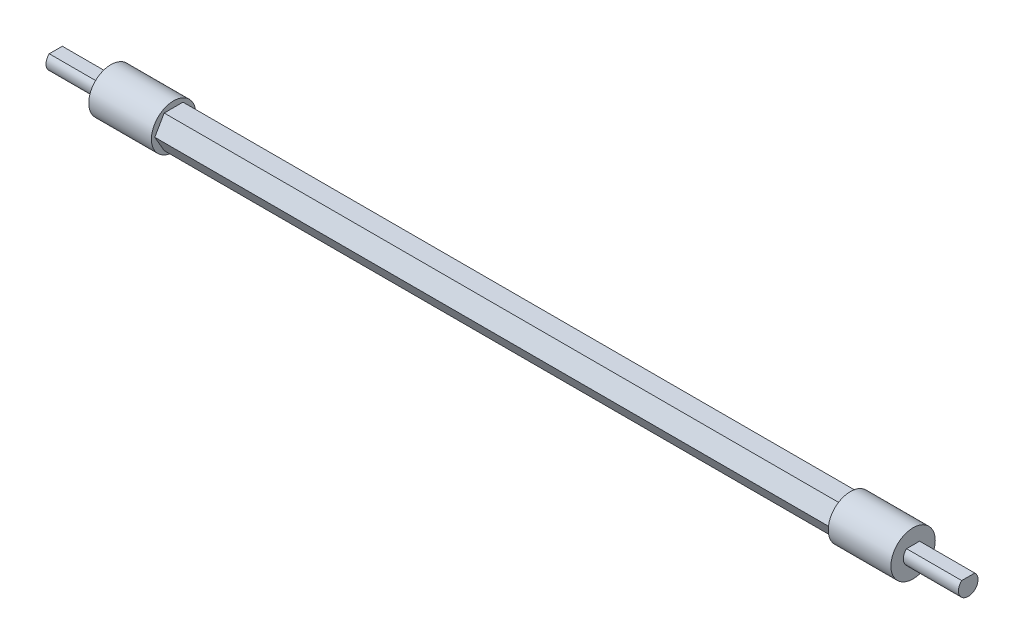
ISO-10303-21;
HEADER;
FILE_DESCRIPTION(('STEP AP214'),'2;1');
FILE_NAME('part.step','',(''),(''),'','','');
FILE_SCHEMA(('AUTOMOTIVE_DESIGN { 1 0 10303 214 1 1 1 1 }'));
ENDSEC;
DATA;
#1=APPLICATION_CONTEXT('core data for automotive mechanical design processes');
#2=APPLICATION_PROTOCOL_DEFINITION('international standard','automotive_design',2000,#1);
#3=PRODUCT_CONTEXT('',#1,'mechanical');
#4=PRODUCT('Part','Part','',(#3));
#5=PRODUCT_RELATED_PRODUCT_CATEGORY('part','',(#4));
#6=PRODUCT_DEFINITION_FORMATION('','',#4);
#7=PRODUCT_DEFINITION_CONTEXT('part definition',#1,'design');
#8=PRODUCT_DEFINITION('design','',#6,#7);
#9=PRODUCT_DEFINITION_SHAPE('','',#8);
#10=(LENGTH_UNIT() NAMED_UNIT(*) SI_UNIT(.MILLI.,.METRE.));
#11=(NAMED_UNIT(*) PLANE_ANGLE_UNIT() SI_UNIT($,.RADIAN.));
#12=(NAMED_UNIT(*) SI_UNIT($,.STERADIAN.) SOLID_ANGLE_UNIT());
#13=UNCERTAINTY_MEASURE_WITH_UNIT(LENGTH_MEASURE(1.E-05),#10,'distance_accuracy_value','');
#14=(GEOMETRIC_REPRESENTATION_CONTEXT(3) GLOBAL_UNCERTAINTY_ASSIGNED_CONTEXT((#13)) GLOBAL_UNIT_ASSIGNED_CONTEXT((#10,
#11,#12)) REPRESENTATION_CONTEXT('',''));
#15=CARTESIAN_POINT('',(0.,0.,0.));
#16=DIRECTION('',(0.,0.,1.));
#17=DIRECTION('',(1.,0.,0.));
#18=AXIS2_PLACEMENT_3D('',#15,#16,#17);
#19=CARTESIAN_POINT('',(-80.,0.,0.));
#20=DIRECTION('',(-1.,0.,0.));
#21=DIRECTION('',(0.,0.,-1.));
#22=AXIS2_PLACEMENT_3D('',#19,#20,#21);
#23=PLANE('',#22);
#24=CARTESIAN_POINT('',(-80.,0.,0.));
#25=DIRECTION('',(1.,0.,0.));
#26=DIRECTION('',(0.,0.,-1.));
#27=AXIS2_PLACEMENT_3D('',#24,#25,#26);
#28=CIRCLE('',#27,4.425);
#29=CARTESIAN_POINT('',(-80.,0.,-4.425));
#30=VERTEX_POINT('',#29);
#31=EDGE_CURVE('E150',#30,#30,#28,.T.);
#32=ORIENTED_EDGE('',*,*,#31,.F.);
#33=EDGE_LOOP('',(#32));
#34=FACE_BOUND('',#33,.T.);
#35=DIRECTION('',(0.,0.,-1.));
#36=VECTOR('',#35,1.);
#37=CARTESIAN_POINT('',(-80.,1.45,0.));
#38=LINE('',#37,#36);
#39=CARTESIAN_POINT('',(-80.,1.45,1.30384048104053));
#40=VERTEX_POINT('',#39);
#41=CARTESIAN_POINT('',(-80.,1.45,-1.30384048104053));
#42=VERTEX_POINT('',#41);
#43=EDGE_CURVE('E61',#40,#42,#38,.T.);
#44=ORIENTED_EDGE('',*,*,#43,.F.);
#45=CARTESIAN_POINT('',(-80.,0.,0.));
#46=DIRECTION('',(1.,0.,0.));
#47=DIRECTION('',(0.,0.,-1.));
#48=AXIS2_PLACEMENT_3D('',#45,#46,#47);
#49=CIRCLE('',#48,1.95);
#50=EDGE_CURVE('E129',#40,#42,#49,.T.);
#51=ORIENTED_EDGE('',*,*,#50,.T.);
#52=EDGE_LOOP('',(#44,#51));
#53=FACE_BOUND('',#52,.T.);
#54=ADVANCED_FACE('F45',(#34,#53),#23,.T.);
#55=CARTESIAN_POINT('',(80.,0.,0.));
#56=DIRECTION('',(1.,0.,0.));
#57=DIRECTION('',(0.,0.,-1.));
#58=AXIS2_PLACEMENT_3D('',#55,#56,#57);
#59=PLANE('',#58);
#60=CARTESIAN_POINT('',(80.,0.,0.));
#61=DIRECTION('',(1.,0.,0.));
#62=DIRECTION('',(0.,0.,-1.));
#63=AXIS2_PLACEMENT_3D('',#60,#61,#62);
#64=CIRCLE('',#63,4.425);
#65=CARTESIAN_POINT('',(80.,0.,-4.425));
#66=VERTEX_POINT('',#65);
#67=EDGE_CURVE('E177',#66,#66,#64,.T.);
#68=ORIENTED_EDGE('',*,*,#67,.T.);
#69=EDGE_LOOP('',(#68));
#70=FACE_BOUND('',#69,.T.);
#71=CARTESIAN_POINT('',(80.,0.,0.));
#72=DIRECTION('',(1.,0.,0.));
#73=DIRECTION('',(0.,0.,-1.));
#74=AXIS2_PLACEMENT_3D('',#71,#72,#73);
#75=CIRCLE('',#74,1.95);
#76=CARTESIAN_POINT('',(80.,1.45,1.30384048104053));
#77=VERTEX_POINT('',#76);
#78=CARTESIAN_POINT('',(80.,1.45,-1.30384048104053));
#79=VERTEX_POINT('',#78);
#80=EDGE_CURVE('E68',#77,#79,#75,.T.);
#81=ORIENTED_EDGE('',*,*,#80,.F.);
#82=DIRECTION('',(0.,0.,-1.));
#83=VECTOR('',#82,1.);
#84=CARTESIAN_POINT('',(80.,1.45,0.));
#85=LINE('',#84,#83);
#86=EDGE_CURVE('E154',#77,#79,#85,.T.);
#87=ORIENTED_EDGE('',*,*,#86,.T.);
#88=EDGE_LOOP('',(#81,#87));
#89=FACE_BOUND('',#88,.T.);
#90=ADVANCED_FACE('F283',(#70,#89),#59,.T.);
#91=CARTESIAN_POINT('',(67.5,-3.24759526419165,0.));
#92=DIRECTION('',(0.,1.,0.));
#93=DIRECTION('',(0.,0.,1.));
#94=AXIS2_PLACEMENT_3D('',#91,#92,#93);
#95=PLANE('',#94);
#96=DIRECTION('',(0.,0.,-1.));
#97=VECTOR('',#96,1.);
#98=CARTESIAN_POINT('',(-67.5,-3.24759526419165,0.));
#99=LINE('',#98,#97);
#100=CARTESIAN_POINT('',(-67.5,-3.24759526419165,1.875));
#101=VERTEX_POINT('',#100);
#102=CARTESIAN_POINT('',(-67.5,-3.24759526419165,-1.875));
#103=VERTEX_POINT('',#102);
#104=EDGE_CURVE('E181',#101,#103,#99,.T.);
#105=ORIENTED_EDGE('',*,*,#104,.T.);
#106=DIRECTION('',(-1.,0.,0.));
#107=VECTOR('',#106,1.);
#108=CARTESIAN_POINT('',(67.5,-3.24759526419165,-1.875));
#109=LINE('',#108,#107);
#110=CARTESIAN_POINT('',(67.5,-3.24759526419165,-1.875));
#111=VERTEX_POINT('',#110);
#112=EDGE_CURVE('E11',#111,#103,#109,.T.);
#113=ORIENTED_EDGE('',*,*,#112,.F.);
#114=DIRECTION('',(0.,0.,-1.));
#115=VECTOR('',#114,1.);
#116=CARTESIAN_POINT('',(67.5,-3.24759526419165,0.));
#117=LINE('',#116,#115);
#118=CARTESIAN_POINT('',(67.5,-3.24759526419165,1.875));
#119=VERTEX_POINT('',#118);
#120=EDGE_CURVE('E185',#119,#111,#117,.T.);
#121=ORIENTED_EDGE('',*,*,#120,.F.);
#122=DIRECTION('',(-1.,0.,0.));
#123=VECTOR('',#122,1.);
#124=CARTESIAN_POINT('',(67.5,-3.24759526419165,1.875));
#125=LINE('',#124,#123);
#126=EDGE_CURVE('E210',#119,#101,#125,.T.);
#127=ORIENTED_EDGE('',*,*,#126,.T.);
#128=EDGE_LOOP('',(#105,#113,#121,#127));
#129=FACE_BOUND('',#128,.T.);
#130=ADVANCED_FACE('F47',(#129),#95,.F.);
#131=CARTESIAN_POINT('',(67.5,-1.62379763209582,-2.8125));
#132=DIRECTION('',(0.,0.5,0.866025403784439));
#133=DIRECTION('',(0.,-0.866025403784439,0.5));
#134=AXIS2_PLACEMENT_3D('',#131,#132,#133);
#135=PLANE('',#134);
#136=DIRECTION('',(0.,0.866025403784439,-0.5));
#137=VECTOR('',#136,1.);
#138=CARTESIAN_POINT('',(-67.5,-1.62379763209582,-2.8125));
#139=LINE('',#138,#137);
#140=CARTESIAN_POINT('',(-67.5,0.,-3.75));
#141=VERTEX_POINT('',#140);
#142=EDGE_CURVE('E214',#103,#141,#139,.T.);
#143=ORIENTED_EDGE('',*,*,#142,.T.);
#144=DIRECTION('',(-1.,0.,0.));
#145=VECTOR('',#144,1.);
#146=CARTESIAN_POINT('',(67.5,0.,-3.75));
#147=LINE('',#146,#145);
#148=CARTESIAN_POINT('',(67.5,0.,-3.75));
#149=VERTEX_POINT('',#148);
#150=EDGE_CURVE('E54',#149,#141,#147,.T.);
#151=ORIENTED_EDGE('',*,*,#150,.F.);
#152=DIRECTION('',(0.,0.866025403784439,-0.5));
#153=VECTOR('',#152,1.);
#154=CARTESIAN_POINT('',(67.5,-1.62379763209582,-2.8125));
#155=LINE('',#154,#153);
#156=EDGE_CURVE('E189',#111,#149,#155,.T.);
#157=ORIENTED_EDGE('',*,*,#156,.F.);
#158=ORIENTED_EDGE('',*,*,#112,.T.);
#159=EDGE_LOOP('',(#143,#151,#157,#158));
#160=FACE_BOUND('',#159,.T.);
#161=ADVANCED_FACE('F253',(#160),#135,.F.);
#162=CARTESIAN_POINT('',(67.5,1.62379763209582,-2.8125));
#163=DIRECTION('',(0.,-0.5,0.866025403784439));
#164=DIRECTION('',(0.,-0.866025403784439,-0.5));
#165=AXIS2_PLACEMENT_3D('',#162,#163,#164);
#166=PLANE('',#165);
#167=DIRECTION('',(0.,0.866025403784439,0.5));
#168=VECTOR('',#167,1.);
#169=CARTESIAN_POINT('',(-67.5,1.62379763209582,-2.8125));
#170=LINE('',#169,#168);
#171=CARTESIAN_POINT('',(-67.5,3.24759526419165,-1.875));
#172=VERTEX_POINT('',#171);
#173=EDGE_CURVE('E218',#141,#172,#170,.T.);
#174=ORIENTED_EDGE('',*,*,#173,.T.);
#175=DIRECTION('',(-1.,0.,0.));
#176=VECTOR('',#175,1.);
#177=CARTESIAN_POINT('',(67.5,3.24759526419165,-1.875));
#178=LINE('',#177,#176);
#179=CARTESIAN_POINT('',(67.5,3.24759526419165,-1.875));
#180=VERTEX_POINT('',#179);
#181=EDGE_CURVE('E244',#180,#172,#178,.T.);
#182=ORIENTED_EDGE('',*,*,#181,.F.);
#183=DIRECTION('',(0.,0.866025403784439,0.5));
#184=VECTOR('',#183,1.);
#185=CARTESIAN_POINT('',(67.5,1.62379763209582,-2.8125));
#186=LINE('',#185,#184);
#187=EDGE_CURVE('E194',#149,#180,#186,.T.);
#188=ORIENTED_EDGE('',*,*,#187,.F.);
#189=ORIENTED_EDGE('',*,*,#150,.T.);
#190=EDGE_LOOP('',(#174,#182,#188,#189));
#191=FACE_BOUND('',#190,.T.);
#192=ADVANCED_FACE('F251',(#191),#166,.F.);
#193=CARTESIAN_POINT('',(67.5,3.24759526419165,0.));
#194=DIRECTION('',(0.,-1.,0.));
#195=DIRECTION('',(0.,0.,-1.));
#196=AXIS2_PLACEMENT_3D('',#193,#194,#195);
#197=PLANE('',#196);
#198=DIRECTION('',(0.,0.,1.));
#199=VECTOR('',#198,1.);
#200=CARTESIAN_POINT('',(-67.5,3.24759526419165,0.));
#201=LINE('',#200,#199);
#202=CARTESIAN_POINT('',(-67.5,3.24759526419165,1.875));
#203=VERTEX_POINT('',#202);
#204=EDGE_CURVE('E222',#172,#203,#201,.T.);
#205=ORIENTED_EDGE('',*,*,#204,.T.);
#206=DIRECTION('',(-1.,0.,0.));
#207=VECTOR('',#206,1.);
#208=CARTESIAN_POINT('',(67.5,3.24759526419165,1.875));
#209=LINE('',#208,#207);
#210=CARTESIAN_POINT('',(67.5,3.24759526419165,1.875));
#211=VERTEX_POINT('',#210);
#212=EDGE_CURVE('E240',#211,#203,#209,.T.);
#213=ORIENTED_EDGE('',*,*,#212,.F.);
#214=DIRECTION('',(0.,0.,1.));
#215=VECTOR('',#214,1.);
#216=CARTESIAN_POINT('',(67.5,3.24759526419165,0.));
#217=LINE('',#216,#215);
#218=EDGE_CURVE('E198',#180,#211,#217,.T.);
#219=ORIENTED_EDGE('',*,*,#218,.F.);
#220=ORIENTED_EDGE('',*,*,#181,.T.);
#221=EDGE_LOOP('',(#205,#213,#219,#220));
#222=FACE_BOUND('',#221,.T.);
#223=ADVANCED_FACE('F259',(#222),#197,.F.);
#224=CARTESIAN_POINT('',(67.5,1.62379763209582,2.8125));
#225=DIRECTION('',(0.,-0.5,-0.866025403784439));
#226=DIRECTION('',(0.,0.866025403784439,-0.5));
#227=AXIS2_PLACEMENT_3D('',#224,#225,#226);
#228=PLANE('',#227);
#229=DIRECTION('',(0.,-0.866025403784439,0.5));
#230=VECTOR('',#229,1.);
#231=CARTESIAN_POINT('',(-67.5,1.62379763209582,2.8125));
#232=LINE('',#231,#230);
#233=CARTESIAN_POINT('',(-67.5,0.,3.75));
#234=VERTEX_POINT('',#233);
#235=EDGE_CURVE('E226',#203,#234,#232,.T.);
#236=ORIENTED_EDGE('',*,*,#235,.T.);
#237=DIRECTION('',(-1.,0.,0.));
#238=VECTOR('',#237,1.);
#239=CARTESIAN_POINT('',(67.5,0.,3.75));
#240=LINE('',#239,#238);
#241=CARTESIAN_POINT('',(67.5,0.,3.75));
#242=VERTEX_POINT('',#241);
#243=EDGE_CURVE('E236',#242,#234,#240,.T.);
#244=ORIENTED_EDGE('',*,*,#243,.F.);
#245=DIRECTION('',(0.,-0.866025403784439,0.5));
#246=VECTOR('',#245,1.);
#247=CARTESIAN_POINT('',(67.5,1.62379763209582,2.8125));
#248=LINE('',#247,#246);
#249=EDGE_CURVE('E202',#211,#242,#248,.T.);
#250=ORIENTED_EDGE('',*,*,#249,.F.);
#251=ORIENTED_EDGE('',*,*,#212,.T.);
#252=EDGE_LOOP('',(#236,#244,#250,#251));
#253=FACE_BOUND('',#252,.T.);
#254=ADVANCED_FACE('F263',(#253),#228,.F.);
#255=CARTESIAN_POINT('',(67.5,-1.62379763209582,2.8125));
#256=DIRECTION('',(0.,0.5,-0.866025403784439));
#257=DIRECTION('',(0.,0.866025403784439,0.5));
#258=AXIS2_PLACEMENT_3D('',#255,#256,#257);
#259=PLANE('',#258);
#260=DIRECTION('',(0.,-0.866025403784439,-0.5));
#261=VECTOR('',#260,1.);
#262=CARTESIAN_POINT('',(-67.5,-1.62379763209582,2.8125));
#263=LINE('',#262,#261);
#264=EDGE_CURVE('E190',#234,#101,#263,.T.);
#265=ORIENTED_EDGE('',*,*,#264,.T.);
#266=ORIENTED_EDGE('',*,*,#126,.F.);
#267=DIRECTION('',(0.,-0.866025403784439,-0.5));
#268=VECTOR('',#267,1.);
#269=CARTESIAN_POINT('',(67.5,-1.62379763209582,2.8125));
#270=LINE('',#269,#268);
#271=EDGE_CURVE('E206',#242,#119,#270,.T.);
#272=ORIENTED_EDGE('',*,*,#271,.F.);
#273=ORIENTED_EDGE('',*,*,#243,.T.);
#274=EDGE_LOOP('',(#265,#266,#272,#273));
#275=FACE_BOUND('',#274,.T.);
#276=ADVANCED_FACE('F270',(#275),#259,.F.);
#277=CARTESIAN_POINT('',(67.5,0.,0.));
#278=DIRECTION('',(1.,0.,0.));
#279=DIRECTION('',(0.,0.,-1.));
#280=AXIS2_PLACEMENT_3D('',#277,#278,#279);
#281=PLANE('',#280);
#282=CARTESIAN_POINT('',(67.5,0.,0.));
#283=DIRECTION('',(1.,0.,0.));
#284=DIRECTION('',(0.,0.,-1.));
#285=AXIS2_PLACEMENT_3D('',#282,#283,#284);
#286=CIRCLE('',#285,4.425);
#287=CARTESIAN_POINT('',(67.5,0.,-4.425));
#288=VERTEX_POINT('',#287);
#289=EDGE_CURVE('E176',#288,#288,#286,.T.);
#290=ORIENTED_EDGE('',*,*,#289,.F.);
#291=EDGE_LOOP('',(#290));
#292=FACE_BOUND('',#291,.T.);
#293=ORIENTED_EDGE('',*,*,#271,.T.);
#294=ORIENTED_EDGE('',*,*,#120,.T.);
#295=ORIENTED_EDGE('',*,*,#156,.T.);
#296=ORIENTED_EDGE('',*,*,#187,.T.);
#297=ORIENTED_EDGE('',*,*,#218,.T.);
#298=ORIENTED_EDGE('',*,*,#249,.T.);
#299=EDGE_LOOP('',(#293,#294,#295,#296,#297,#298));
#300=FACE_BOUND('',#299,.T.);
#301=ADVANCED_FACE('F266',(#292,#300),#281,.F.);
#302=CARTESIAN_POINT('',(80.,0.,0.));
#303=DIRECTION('',(-1.,0.,0.));
#304=DIRECTION('',(0.,0.,1.));
#305=AXIS2_PLACEMENT_3D('',#302,#303,#304);
#306=CYLINDRICAL_SURFACE('',#305,4.425);
#307=ORIENTED_EDGE('',*,*,#67,.F.);
#308=EDGE_LOOP('',(#307));
#309=FACE_BOUND('',#308,.T.);
#310=ORIENTED_EDGE('',*,*,#289,.T.);
#311=EDGE_LOOP('',(#310));
#312=FACE_BOUND('',#311,.T.);
#313=ADVANCED_FACE('F277',(#309,#312),#306,.T.);
#314=CARTESIAN_POINT('',(91.,1.45,0.));
#315=DIRECTION('',(0.,1.,0.));
#316=DIRECTION('',(0.,0.,1.));
#317=AXIS2_PLACEMENT_3D('',#314,#315,#316);
#318=PLANE('',#317);
#319=ORIENTED_EDGE('',*,*,#86,.F.);
#320=DIRECTION('',(-1.,0.,0.));
#321=VECTOR('',#320,1.);
#322=CARTESIAN_POINT('',(91.,1.45,1.30384048104053));
#323=LINE('',#322,#321);
#324=CARTESIAN_POINT('',(91.,1.45,1.30384048104053));
#325=VERTEX_POINT('',#324);
#326=EDGE_CURVE('E173',#325,#77,#323,.T.);
#327=ORIENTED_EDGE('',*,*,#326,.F.);
#328=DIRECTION('',(0.,0.,-1.));
#329=VECTOR('',#328,1.);
#330=CARTESIAN_POINT('',(91.,1.45,0.));
#331=LINE('',#330,#329);
#332=CARTESIAN_POINT('',(91.,1.45,-1.30384048104053));
#333=VERTEX_POINT('',#332);
#334=EDGE_CURVE('E158',#325,#333,#331,.T.);
#335=ORIENTED_EDGE('',*,*,#334,.T.);
#336=DIRECTION('',(-1.,0.,0.));
#337=VECTOR('',#336,1.);
#338=CARTESIAN_POINT('',(91.,1.45,-1.30384048104053));
#339=LINE('',#338,#337);
#340=EDGE_CURVE('E165',#333,#79,#339,.T.);
#341=ORIENTED_EDGE('',*,*,#340,.T.);
#342=EDGE_LOOP('',(#319,#327,#335,#341));
#343=FACE_BOUND('',#342,.T.);
#344=ADVANCED_FACE('F309',(#343),#318,.T.);
#345=CARTESIAN_POINT('',(91.,0.,0.));
#346=DIRECTION('',(-1.,0.,0.));
#347=DIRECTION('',(0.,0.,1.));
#348=AXIS2_PLACEMENT_3D('',#345,#346,#347);
#349=CYLINDRICAL_SURFACE('',#348,1.95);
#350=ORIENTED_EDGE('',*,*,#80,.T.);
#351=ORIENTED_EDGE('',*,*,#340,.F.);
#352=CARTESIAN_POINT('',(91.,0.,0.));
#353=DIRECTION('',(1.,0.,0.));
#354=DIRECTION('',(0.,0.,-1.));
#355=AXIS2_PLACEMENT_3D('',#352,#353,#354);
#356=CIRCLE('',#355,1.95);
#357=EDGE_CURVE('E162',#325,#333,#356,.T.);
#358=ORIENTED_EDGE('',*,*,#357,.F.);
#359=ORIENTED_EDGE('',*,*,#326,.T.);
#360=EDGE_LOOP('',(#350,#351,#358,#359));
#361=FACE_BOUND('',#360,.T.);
#362=ADVANCED_FACE('F305',(#361),#349,.T.);
#363=CARTESIAN_POINT('',(91.,0.,0.));
#364=DIRECTION('',(1.,0.,0.));
#365=DIRECTION('',(0.,0.,-1.));
#366=AXIS2_PLACEMENT_3D('',#363,#364,#365);
#367=PLANE('',#366);
#368=ORIENTED_EDGE('',*,*,#334,.F.);
#369=ORIENTED_EDGE('',*,*,#357,.T.);
#370=EDGE_LOOP('',(#368,#369));
#371=FACE_BOUND('',#370,.T.);
#372=ADVANCED_FACE('F301',(#371),#367,.T.);
#373=CARTESIAN_POINT('',(-80.,0.,0.));
#374=DIRECTION('',(1.,0.,0.));
#375=DIRECTION('',(0.,0.,-1.));
#376=AXIS2_PLACEMENT_3D('',#373,#374,#375);
#377=CYLINDRICAL_SURFACE('',#376,4.425);
#378=ORIENTED_EDGE('',*,*,#31,.T.);
#379=EDGE_LOOP('',(#378));
#380=FACE_BOUND('',#379,.T.);
#381=CARTESIAN_POINT('',(-67.5,0.,0.));
#382=DIRECTION('',(1.,0.,0.));
#383=DIRECTION('',(0.,0.,-1.));
#384=AXIS2_PLACEMENT_3D('',#381,#382,#383);
#385=CIRCLE('',#384,4.425);
#386=CARTESIAN_POINT('',(-67.5,0.,-4.425));
#387=VERTEX_POINT('',#386);
#388=EDGE_CURVE('E137',#387,#387,#385,.T.);
#389=ORIENTED_EDGE('',*,*,#388,.F.);
#390=EDGE_LOOP('',(#389));
#391=FACE_BOUND('',#390,.T.);
#392=ADVANCED_FACE('F298',(#380,#391),#377,.T.);
#393=CARTESIAN_POINT('',(-67.5,0.,0.));
#394=DIRECTION('',(-1.,0.,0.));
#395=DIRECTION('',(0.,0.,-1.));
#396=AXIS2_PLACEMENT_3D('',#393,#394,#395);
#397=PLANE('',#396);
#398=ORIENTED_EDGE('',*,*,#104,.F.);
#399=ORIENTED_EDGE('',*,*,#264,.F.);
#400=ORIENTED_EDGE('',*,*,#235,.F.);
#401=ORIENTED_EDGE('',*,*,#204,.F.);
#402=ORIENTED_EDGE('',*,*,#173,.F.);
#403=ORIENTED_EDGE('',*,*,#142,.F.);
#404=EDGE_LOOP('',(#398,#399,#400,#401,#402,#403));
#405=FACE_BOUND('',#404,.T.);
#406=ORIENTED_EDGE('',*,*,#388,.T.);
#407=EDGE_LOOP('',(#406));
#408=FACE_BOUND('',#407,.T.);
#409=ADVANCED_FACE('F256',(#405,#408),#397,.F.);
#410=CARTESIAN_POINT('',(-91.,1.45,0.));
#411=DIRECTION('',(0.,-1.,0.));
#412=DIRECTION('',(0.,0.,-1.));
#413=AXIS2_PLACEMENT_3D('',#410,#411,#412);
#414=PLANE('',#413);
#415=ORIENTED_EDGE('',*,*,#43,.T.);
#416=DIRECTION('',(1.,0.,0.));
#417=VECTOR('',#416,1.);
#418=CARTESIAN_POINT('',(-91.,1.45,-1.30384048104053));
#419=LINE('',#418,#417);
#420=CARTESIAN_POINT('',(-91.,1.45,-1.30384048104053));
#421=VERTEX_POINT('',#420);
#422=EDGE_CURVE('E131',#421,#42,#419,.T.);
#423=ORIENTED_EDGE('',*,*,#422,.F.);
#424=DIRECTION('',(0.,0.,-1.));
#425=VECTOR('',#424,1.);
#426=CARTESIAN_POINT('',(-91.,1.45,0.));
#427=LINE('',#426,#425);
#428=CARTESIAN_POINT('',(-91.,1.45,1.30384048104053));
#429=VERTEX_POINT('',#428);
#430=EDGE_CURVE('E124',#429,#421,#427,.T.);
#431=ORIENTED_EDGE('',*,*,#430,.F.);
#432=DIRECTION('',(1.,0.,0.));
#433=VECTOR('',#432,1.);
#434=CARTESIAN_POINT('',(-91.,1.45,1.30384048104053));
#435=LINE('',#434,#433);
#436=EDGE_CURVE('E138',#429,#40,#435,.T.);
#437=ORIENTED_EDGE('',*,*,#436,.T.);
#438=EDGE_LOOP('',(#415,#423,#431,#437));
#439=FACE_BOUND('',#438,.T.);
#440=ADVANCED_FACE('F132',(#439),#414,.F.);
#441=CARTESIAN_POINT('',(-91.,0.,0.));
#442=DIRECTION('',(1.,0.,0.));
#443=DIRECTION('',(0.,0.,-1.));
#444=AXIS2_PLACEMENT_3D('',#441,#442,#443);
#445=CYLINDRICAL_SURFACE('',#444,1.95);
#446=ORIENTED_EDGE('',*,*,#50,.F.);
#447=ORIENTED_EDGE('',*,*,#436,.F.);
#448=CARTESIAN_POINT('',(-91.,0.,0.));
#449=DIRECTION('',(1.,0.,0.));
#450=DIRECTION('',(0.,0.,-1.));
#451=AXIS2_PLACEMENT_3D('',#448,#449,#450);
#452=CIRCLE('',#451,1.95);
#453=EDGE_CURVE('E127',#429,#421,#452,.T.);
#454=ORIENTED_EDGE('',*,*,#453,.T.);
#455=ORIENTED_EDGE('',*,*,#422,.T.);
#456=EDGE_LOOP('',(#446,#447,#454,#455));
#457=FACE_BOUND('',#456,.T.);
#458=ADVANCED_FACE('F140',(#457),#445,.T.);
#459=CARTESIAN_POINT('',(-91.,0.,0.));
#460=DIRECTION('',(-1.,0.,0.));
#461=DIRECTION('',(0.,0.,-1.));
#462=AXIS2_PLACEMENT_3D('',#459,#460,#461);
#463=PLANE('',#462);
#464=ORIENTED_EDGE('',*,*,#430,.T.);
#465=ORIENTED_EDGE('',*,*,#453,.F.);
#466=EDGE_LOOP('',(#464,#465));
#467=FACE_BOUND('',#466,.T.);
#468=ADVANCED_FACE('F125',(#467),#463,.T.);
#469=CLOSED_SHELL('',(#54,#90,#130,#161,#192,#223,#254,#276,#301,#313,#344,#362,#372,#392,#409,
#440,#458,#468));
#470=MANIFOLD_SOLID_BREP('B2',#469);
#471=ADVANCED_BREP_SHAPE_REPRESENTATION('',(#18,#470),#14);
#472=SHAPE_DEFINITION_REPRESENTATION(#9,#471);
ENDSEC;
END-ISO-10303-21;
